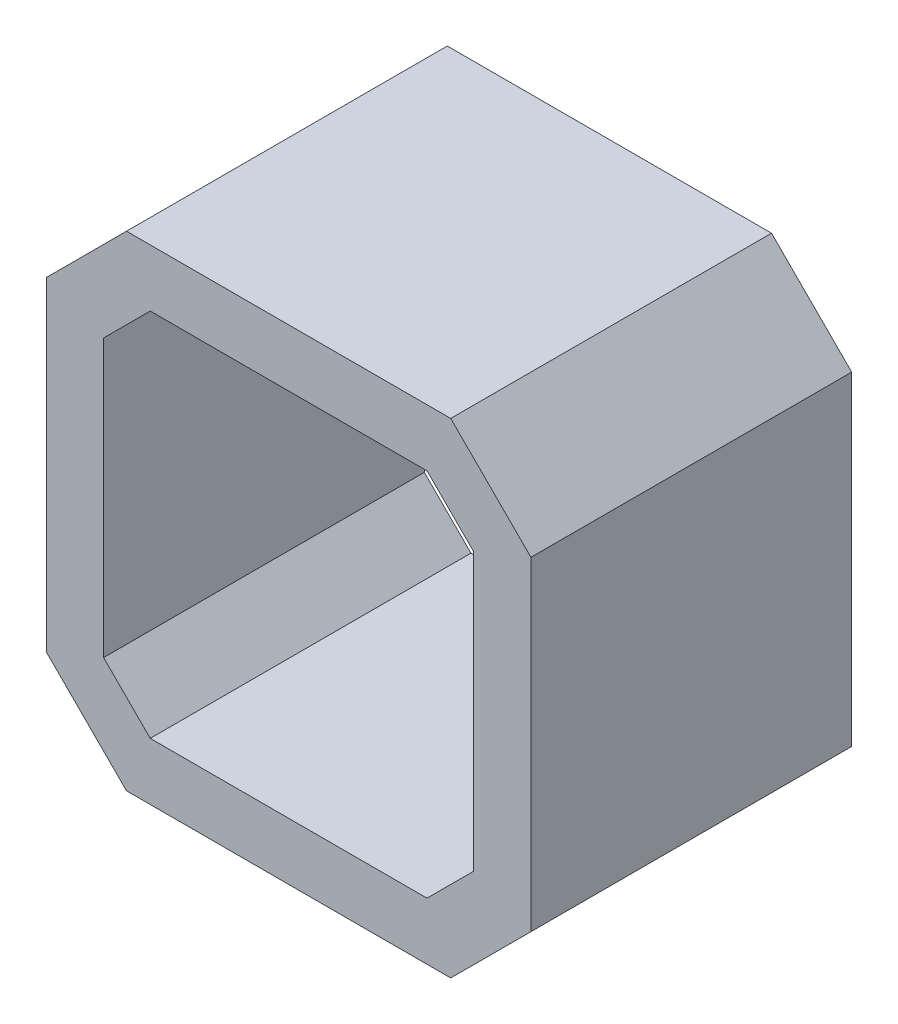
ISO-10303-21;
HEADER;
FILE_DESCRIPTION(('STEP AP214'),'2;1');
FILE_NAME('part.step','',(''),(''),'','','');
FILE_SCHEMA(('AUTOMOTIVE_DESIGN { 1 0 10303 214 1 1 1 1 }'));
ENDSEC;
DATA;
#1=APPLICATION_CONTEXT('core data for automotive mechanical design processes');
#2=APPLICATION_PROTOCOL_DEFINITION('international standard','automotive_design',2000,#1);
#3=PRODUCT_CONTEXT('',#1,'mechanical');
#4=PRODUCT('Part','Part','',(#3));
#5=PRODUCT_RELATED_PRODUCT_CATEGORY('part','',(#4));
#6=PRODUCT_DEFINITION_FORMATION('','',#4);
#7=PRODUCT_DEFINITION_CONTEXT('part definition',#1,'design');
#8=PRODUCT_DEFINITION('design','',#6,#7);
#9=PRODUCT_DEFINITION_SHAPE('','',#8);
#10=(LENGTH_UNIT() NAMED_UNIT(*) SI_UNIT(.MILLI.,.METRE.));
#11=(NAMED_UNIT(*) PLANE_ANGLE_UNIT() SI_UNIT($,.RADIAN.));
#12=(NAMED_UNIT(*) SI_UNIT($,.STERADIAN.) SOLID_ANGLE_UNIT());
#13=UNCERTAINTY_MEASURE_WITH_UNIT(LENGTH_MEASURE(1.E-05),#10,'distance_accuracy_value','');
#14=(GEOMETRIC_REPRESENTATION_CONTEXT(3) GLOBAL_UNCERTAINTY_ASSIGNED_CONTEXT((#13)) GLOBAL_UNIT_ASSIGNED_CONTEXT((#10,
#11,#12)) REPRESENTATION_CONTEXT('',''));
#15=CARTESIAN_POINT('',(0.,0.,0.));
#16=DIRECTION('',(0.,0.,1.));
#17=DIRECTION('',(1.,0.,0.));
#18=AXIS2_PLACEMENT_3D('',#15,#16,#17);
#19=CARTESIAN_POINT('',(0.,0.,28.));
#20=DIRECTION('',(0.,0.,-1.));
#21=DIRECTION('',(-1.,0.,0.));
#22=AXIS2_PLACEMENT_3D('',#19,#20,#21);
#23=PLANE('',#22);
#24=DIRECTION('',(0.,-1.,0.));
#25=VECTOR('',#24,1.);
#26=CARTESIAN_POINT('',(-21.15,-14.15,28.));
#27=LINE('',#26,#25);
#28=CARTESIAN_POINT('',(-21.15,14.15,28.));
#29=VERTEX_POINT('',#28);
#30=CARTESIAN_POINT('',(-21.15,-14.15,28.));
#31=VERTEX_POINT('',#30);
#32=EDGE_CURVE('E211',#29,#31,#27,.T.);
#33=ORIENTED_EDGE('',*,*,#32,.T.);
#34=DIRECTION('',(0.707106781186547,-0.707106781186547,0.));
#35=VECTOR('',#34,1.);
#36=CARTESIAN_POINT('',(-21.15,-14.15,28.));
#37=LINE('',#36,#35);
#38=CARTESIAN_POINT('',(-14.15,-21.15,28.));
#39=VERTEX_POINT('',#38);
#40=EDGE_CURVE('E214',#31,#39,#37,.T.);
#41=ORIENTED_EDGE('',*,*,#40,.T.);
#42=DIRECTION('',(1.,0.,0.));
#43=VECTOR('',#42,1.);
#44=CARTESIAN_POINT('',(-14.15,-21.15,28.));
#45=LINE('',#44,#43);
#46=CARTESIAN_POINT('',(14.15,-21.15,28.));
#47=VERTEX_POINT('',#46);
#48=EDGE_CURVE('E217',#39,#47,#45,.T.);
#49=ORIENTED_EDGE('',*,*,#48,.T.);
#50=DIRECTION('',(0.707106781186547,0.707106781186547,0.));
#51=VECTOR('',#50,1.);
#52=CARTESIAN_POINT('',(14.15,-21.15,28.));
#53=LINE('',#52,#51);
#54=CARTESIAN_POINT('',(21.15,-14.15,28.));
#55=VERTEX_POINT('',#54);
#56=EDGE_CURVE('E219',#47,#55,#53,.T.);
#57=ORIENTED_EDGE('',*,*,#56,.T.);
#58=DIRECTION('',(0.,1.,0.));
#59=VECTOR('',#58,1.);
#60=CARTESIAN_POINT('',(21.15,-14.15,28.));
#61=LINE('',#60,#59);
#62=CARTESIAN_POINT('',(21.15,14.15,28.));
#63=VERTEX_POINT('',#62);
#64=EDGE_CURVE('E221',#55,#63,#61,.T.);
#65=ORIENTED_EDGE('',*,*,#64,.T.);
#66=DIRECTION('',(-0.707106781186547,0.707106781186547,0.));
#67=VECTOR('',#66,1.);
#68=CARTESIAN_POINT('',(14.15,21.15,28.));
#69=LINE('',#68,#67);
#70=CARTESIAN_POINT('',(14.15,21.15,28.));
#71=VERTEX_POINT('',#70);
#72=EDGE_CURVE('E223',#63,#71,#69,.T.);
#73=ORIENTED_EDGE('',*,*,#72,.T.);
#74=DIRECTION('',(-1.,0.,0.));
#75=VECTOR('',#74,1.);
#76=CARTESIAN_POINT('',(-14.15,21.15,28.));
#77=LINE('',#76,#75);
#78=CARTESIAN_POINT('',(-14.15,21.15,28.));
#79=VERTEX_POINT('',#78);
#80=EDGE_CURVE('E225',#71,#79,#77,.T.);
#81=ORIENTED_EDGE('',*,*,#80,.T.);
#82=DIRECTION('',(-0.707106781186547,-0.707106781186547,0.));
#83=VECTOR('',#82,1.);
#84=CARTESIAN_POINT('',(-21.15,14.15,28.));
#85=LINE('',#84,#83);
#86=EDGE_CURVE('E227',#79,#29,#85,.T.);
#87=ORIENTED_EDGE('',*,*,#86,.T.);
#88=EDGE_LOOP('',(#33,#41,#49,#57,#65,#73,#81,#87));
#89=FACE_BOUND('',#88,.T.);
#90=DIRECTION('',(-0.707106781186547,-0.707106781186547,0.));
#91=VECTOR('',#90,1.);
#92=CARTESIAN_POINT('',(-16.15,12.0789321881345,28.));
#93=LINE('',#92,#91);
#94=CARTESIAN_POINT('',(-12.0789321881345,16.15,28.));
#95=VERTEX_POINT('',#94);
#96=CARTESIAN_POINT('',(-16.15,12.0789321881345,28.));
#97=VERTEX_POINT('',#96);
#98=EDGE_CURVE('E146',#95,#97,#93,.T.);
#99=ORIENTED_EDGE('',*,*,#98,.F.);
#100=DIRECTION('',(-1.,0.,0.));
#101=VECTOR('',#100,1.);
#102=CARTESIAN_POINT('',(-12.0789321881345,16.15,28.));
#103=LINE('',#102,#101);
#104=CARTESIAN_POINT('',(12.0789321881345,16.15,28.));
#105=VERTEX_POINT('',#104);
#106=EDGE_CURVE('E179',#105,#95,#103,.T.);
#107=ORIENTED_EDGE('',*,*,#106,.F.);
#108=DIRECTION('',(-0.707106781186547,0.707106781186547,0.));
#109=VECTOR('',#108,1.);
#110=CARTESIAN_POINT('',(12.0789321881345,16.15,28.));
#111=LINE('',#110,#109);
#112=CARTESIAN_POINT('',(16.15,12.0789321881345,28.));
#113=VERTEX_POINT('',#112);
#114=EDGE_CURVE('E177',#113,#105,#111,.T.);
#115=ORIENTED_EDGE('',*,*,#114,.F.);
#116=DIRECTION('',(0.,1.,0.));
#117=VECTOR('',#116,1.);
#118=CARTESIAN_POINT('',(16.15,-12.0789321881345,28.));
#119=LINE('',#118,#117);
#120=CARTESIAN_POINT('',(16.15,-12.0789321881345,28.));
#121=VERTEX_POINT('',#120);
#122=EDGE_CURVE('E175',#121,#113,#119,.T.);
#123=ORIENTED_EDGE('',*,*,#122,.F.);
#124=DIRECTION('',(0.707106781186547,0.707106781186547,0.));
#125=VECTOR('',#124,1.);
#126=CARTESIAN_POINT('',(12.0789321881345,-16.15,28.));
#127=LINE('',#126,#125);
#128=CARTESIAN_POINT('',(12.0789321881345,-16.15,28.));
#129=VERTEX_POINT('',#128);
#130=EDGE_CURVE('E173',#129,#121,#127,.T.);
#131=ORIENTED_EDGE('',*,*,#130,.F.);
#132=DIRECTION('',(1.,0.,0.));
#133=VECTOR('',#132,1.);
#134=CARTESIAN_POINT('',(-12.0789321881345,-16.15,28.));
#135=LINE('',#134,#133);
#136=CARTESIAN_POINT('',(-12.0789321881345,-16.15,28.));
#137=VERTEX_POINT('',#136);
#138=EDGE_CURVE('E169',#137,#129,#135,.T.);
#139=ORIENTED_EDGE('',*,*,#138,.F.);
#140=DIRECTION('',(0.707106781186547,-0.707106781186547,0.));
#141=VECTOR('',#140,1.);
#142=CARTESIAN_POINT('',(-16.15,-12.0789321881345,28.));
#143=LINE('',#142,#141);
#144=CARTESIAN_POINT('',(-16.15,-12.0789321881345,28.));
#145=VERTEX_POINT('',#144);
#146=EDGE_CURVE('E167',#145,#137,#143,.T.);
#147=ORIENTED_EDGE('',*,*,#146,.F.);
#148=DIRECTION('',(0.,-1.,0.));
#149=VECTOR('',#148,1.);
#150=CARTESIAN_POINT('',(-16.15,-12.0789321881345,28.));
#151=LINE('',#150,#149);
#152=EDGE_CURVE('E154',#97,#145,#151,.T.);
#153=ORIENTED_EDGE('',*,*,#152,.F.);
#154=EDGE_LOOP('',(#99,#107,#115,#123,#131,#139,#147,#153));
#155=FACE_BOUND('',#154,.T.);
#156=ADVANCED_FACE('F33',(#89,#155),#23,.F.);
#157=CARTESIAN_POINT('',(0.,0.,0.));
#158=DIRECTION('',(0.,0.,-1.));
#159=DIRECTION('',(-1.,0.,0.));
#160=AXIS2_PLACEMENT_3D('',#157,#158,#159);
#161=PLANE('',#160);
#162=DIRECTION('',(0.,-1.,0.));
#163=VECTOR('',#162,1.);
#164=CARTESIAN_POINT('',(-21.15,-14.15,0.));
#165=LINE('',#164,#163);
#166=CARTESIAN_POINT('',(-21.15,14.15,0.));
#167=VERTEX_POINT('',#166);
#168=CARTESIAN_POINT('',(-21.15,-14.15,0.));
#169=VERTEX_POINT('',#168);
#170=EDGE_CURVE('E162',#167,#169,#165,.T.);
#171=ORIENTED_EDGE('',*,*,#170,.F.);
#172=DIRECTION('',(-0.707106781186547,-0.707106781186547,0.));
#173=VECTOR('',#172,1.);
#174=CARTESIAN_POINT('',(-21.15,14.15,0.));
#175=LINE('',#174,#173);
#176=CARTESIAN_POINT('',(-14.15,21.15,0.));
#177=VERTEX_POINT('',#176);
#178=EDGE_CURVE('E215',#177,#167,#175,.T.);
#179=ORIENTED_EDGE('',*,*,#178,.F.);
#180=DIRECTION('',(-1.,0.,0.));
#181=VECTOR('',#180,1.);
#182=CARTESIAN_POINT('',(-14.15,21.15,0.));
#183=LINE('',#182,#181);
#184=CARTESIAN_POINT('',(14.15,21.15,0.));
#185=VERTEX_POINT('',#184);
#186=EDGE_CURVE('E242',#185,#177,#183,.T.);
#187=ORIENTED_EDGE('',*,*,#186,.F.);
#188=DIRECTION('',(-0.707106781186547,0.707106781186547,0.));
#189=VECTOR('',#188,1.);
#190=CARTESIAN_POINT('',(14.15,21.15,0.));
#191=LINE('',#190,#189);
#192=CARTESIAN_POINT('',(21.15,14.15,0.));
#193=VERTEX_POINT('',#192);
#194=EDGE_CURVE('E240',#193,#185,#191,.T.);
#195=ORIENTED_EDGE('',*,*,#194,.F.);
#196=DIRECTION('',(0.,1.,0.));
#197=VECTOR('',#196,1.);
#198=CARTESIAN_POINT('',(21.15,-14.15,0.));
#199=LINE('',#198,#197);
#200=CARTESIAN_POINT('',(21.15,-14.15,0.));
#201=VERTEX_POINT('',#200);
#202=EDGE_CURVE('E238',#201,#193,#199,.T.);
#203=ORIENTED_EDGE('',*,*,#202,.F.);
#204=DIRECTION('',(0.707106781186547,0.707106781186547,0.));
#205=VECTOR('',#204,1.);
#206=CARTESIAN_POINT('',(14.15,-21.15,0.));
#207=LINE('',#206,#205);
#208=CARTESIAN_POINT('',(14.15,-21.15,0.));
#209=VERTEX_POINT('',#208);
#210=EDGE_CURVE('E236',#209,#201,#207,.T.);
#211=ORIENTED_EDGE('',*,*,#210,.F.);
#212=DIRECTION('',(1.,0.,0.));
#213=VECTOR('',#212,1.);
#214=CARTESIAN_POINT('',(-14.15,-21.15,0.));
#215=LINE('',#214,#213);
#216=CARTESIAN_POINT('',(-14.15,-21.15,0.));
#217=VERTEX_POINT('',#216);
#218=EDGE_CURVE('E234',#217,#209,#215,.T.);
#219=ORIENTED_EDGE('',*,*,#218,.F.);
#220=DIRECTION('',(0.707106781186547,-0.707106781186547,0.));
#221=VECTOR('',#220,1.);
#222=CARTESIAN_POINT('',(-21.15,-14.15,0.));
#223=LINE('',#222,#221);
#224=EDGE_CURVE('E232',#169,#217,#223,.T.);
#225=ORIENTED_EDGE('',*,*,#224,.F.);
#226=EDGE_LOOP('',(#171,#179,#187,#195,#203,#211,#219,#225));
#227=FACE_BOUND('',#226,.T.);
#228=DIRECTION('',(-1.,0.,0.));
#229=VECTOR('',#228,1.);
#230=CARTESIAN_POINT('',(-12.0789321881345,16.15,0.));
#231=LINE('',#230,#229);
#232=CARTESIAN_POINT('',(12.0789321881345,16.15,0.));
#233=VERTEX_POINT('',#232);
#234=CARTESIAN_POINT('',(-12.0789321881345,16.15,0.));
#235=VERTEX_POINT('',#234);
#236=EDGE_CURVE('E155',#233,#235,#231,.T.);
#237=ORIENTED_EDGE('',*,*,#236,.T.);
#238=DIRECTION('',(-0.707106781186547,-0.707106781186547,0.));
#239=VECTOR('',#238,1.);
#240=CARTESIAN_POINT('',(-16.15,12.0789321881345,0.));
#241=LINE('',#240,#239);
#242=CARTESIAN_POINT('',(-16.15,12.0789321881345,0.));
#243=VERTEX_POINT('',#242);
#244=EDGE_CURVE('E56',#235,#243,#241,.T.);
#245=ORIENTED_EDGE('',*,*,#244,.T.);
#246=DIRECTION('',(0.,-1.,0.));
#247=VECTOR('',#246,1.);
#248=CARTESIAN_POINT('',(-16.15,-12.0789321881345,0.));
#249=LINE('',#248,#247);
#250=CARTESIAN_POINT('',(-16.15,-12.0789321881345,0.));
#251=VERTEX_POINT('',#250);
#252=EDGE_CURVE('E161',#243,#251,#249,.T.);
#253=ORIENTED_EDGE('',*,*,#252,.T.);
#254=DIRECTION('',(0.707106781186547,-0.707106781186547,0.));
#255=VECTOR('',#254,1.);
#256=CARTESIAN_POINT('',(-16.15,-12.0789321881345,0.));
#257=LINE('',#256,#255);
#258=CARTESIAN_POINT('',(-12.0789321881345,-16.15,0.));
#259=VERTEX_POINT('',#258);
#260=EDGE_CURVE('E183',#251,#259,#257,.T.);
#261=ORIENTED_EDGE('',*,*,#260,.T.);
#262=DIRECTION('',(1.,0.,0.));
#263=VECTOR('',#262,1.);
#264=CARTESIAN_POINT('',(-12.0789321881345,-16.15,0.));
#265=LINE('',#264,#263);
#266=CARTESIAN_POINT('',(12.0789321881345,-16.15,0.));
#267=VERTEX_POINT('',#266);
#268=EDGE_CURVE('E186',#259,#267,#265,.T.);
#269=ORIENTED_EDGE('',*,*,#268,.T.);
#270=DIRECTION('',(0.707106781186547,0.707106781186547,0.));
#271=VECTOR('',#270,1.);
#272=CARTESIAN_POINT('',(12.0789321881345,-16.15,0.));
#273=LINE('',#272,#271);
#274=CARTESIAN_POINT('',(16.15,-12.0789321881345,0.));
#275=VERTEX_POINT('',#274);
#276=EDGE_CURVE('E189',#267,#275,#273,.T.);
#277=ORIENTED_EDGE('',*,*,#276,.T.);
#278=DIRECTION('',(0.,1.,0.));
#279=VECTOR('',#278,1.);
#280=CARTESIAN_POINT('',(16.15,-12.0789321881345,0.));
#281=LINE('',#280,#279);
#282=CARTESIAN_POINT('',(16.15,12.0789321881345,0.));
#283=VERTEX_POINT('',#282);
#284=EDGE_CURVE('E192',#275,#283,#281,.T.);
#285=ORIENTED_EDGE('',*,*,#284,.T.);
#286=DIRECTION('',(-0.707106781186547,0.707106781186547,0.));
#287=VECTOR('',#286,1.);
#288=CARTESIAN_POINT('',(12.0789321881345,16.15,0.));
#289=LINE('',#288,#287);
#290=EDGE_CURVE('E195',#283,#233,#289,.T.);
#291=ORIENTED_EDGE('',*,*,#290,.T.);
#292=EDGE_LOOP('',(#237,#245,#253,#261,#269,#277,#285,#291));
#293=FACE_BOUND('',#292,.T.);
#294=ADVANCED_FACE('F272',(#227,#293),#161,.T.);
#295=CARTESIAN_POINT('',(-21.15,-14.15,28.));
#296=DIRECTION('',(1.,0.,0.));
#297=DIRECTION('',(0.,0.,-1.));
#298=AXIS2_PLACEMENT_3D('',#295,#296,#297);
#299=PLANE('',#298);
#300=ORIENTED_EDGE('',*,*,#170,.T.);
#301=DIRECTION('',(0.,0.,-1.));
#302=VECTOR('',#301,1.);
#303=CARTESIAN_POINT('',(-21.15,-14.15,28.));
#304=LINE('',#303,#302);
#305=EDGE_CURVE('E11',#31,#169,#304,.T.);
#306=ORIENTED_EDGE('',*,*,#305,.F.);
#307=ORIENTED_EDGE('',*,*,#32,.F.);
#308=DIRECTION('',(0.,0.,-1.));
#309=VECTOR('',#308,1.);
#310=CARTESIAN_POINT('',(-21.15,14.15,28.));
#311=LINE('',#310,#309);
#312=EDGE_CURVE('E229',#29,#167,#311,.T.);
#313=ORIENTED_EDGE('',*,*,#312,.T.);
#314=EDGE_LOOP('',(#300,#306,#307,#313));
#315=FACE_BOUND('',#314,.T.);
#316=ADVANCED_FACE('F35',(#315),#299,.F.);
#317=CARTESIAN_POINT('',(-21.15,-14.15,28.));
#318=DIRECTION('',(0.707106781186548,0.707106781186548,0.));
#319=DIRECTION('',(-0.707106781186548,0.707106781186548,0.));
#320=AXIS2_PLACEMENT_3D('',#317,#318,#319);
#321=PLANE('',#320);
#322=ORIENTED_EDGE('',*,*,#224,.T.);
#323=DIRECTION('',(0.,0.,-1.));
#324=VECTOR('',#323,1.);
#325=CARTESIAN_POINT('',(-14.15,-21.15,28.));
#326=LINE('',#325,#324);
#327=EDGE_CURVE('E41',#39,#217,#326,.T.);
#328=ORIENTED_EDGE('',*,*,#327,.F.);
#329=ORIENTED_EDGE('',*,*,#40,.F.);
#330=ORIENTED_EDGE('',*,*,#305,.T.);
#331=EDGE_LOOP('',(#322,#328,#329,#330));
#332=FACE_BOUND('',#331,.T.);
#333=ADVANCED_FACE('F289',(#332),#321,.F.);
#334=CARTESIAN_POINT('',(-14.15,-21.15,28.));
#335=DIRECTION('',(0.,1.,0.));
#336=DIRECTION('',(0.,0.,1.));
#337=AXIS2_PLACEMENT_3D('',#334,#335,#336);
#338=PLANE('',#337);
#339=ORIENTED_EDGE('',*,*,#218,.T.);
#340=DIRECTION('',(0.,0.,-1.));
#341=VECTOR('',#340,1.);
#342=CARTESIAN_POINT('',(14.15,-21.15,28.));
#343=LINE('',#342,#341);
#344=EDGE_CURVE('E259',#47,#209,#343,.T.);
#345=ORIENTED_EDGE('',*,*,#344,.F.);
#346=ORIENTED_EDGE('',*,*,#48,.F.);
#347=ORIENTED_EDGE('',*,*,#327,.T.);
#348=EDGE_LOOP('',(#339,#345,#346,#347));
#349=FACE_BOUND('',#348,.T.);
#350=ADVANCED_FACE('F266',(#349),#338,.F.);
#351=CARTESIAN_POINT('',(14.15,-21.15,28.));
#352=DIRECTION('',(-0.707106781186548,0.707106781186548,0.));
#353=DIRECTION('',(-0.707106781186548,-0.707106781186548,0.));
#354=AXIS2_PLACEMENT_3D('',#351,#352,#353);
#355=PLANE('',#354);
#356=ORIENTED_EDGE('',*,*,#210,.T.);
#357=DIRECTION('',(0.,0.,-1.));
#358=VECTOR('',#357,1.);
#359=CARTESIAN_POINT('',(21.15,-14.15,28.));
#360=LINE('',#359,#358);
#361=EDGE_CURVE('E256',#55,#201,#360,.T.);
#362=ORIENTED_EDGE('',*,*,#361,.F.);
#363=ORIENTED_EDGE('',*,*,#56,.F.);
#364=ORIENTED_EDGE('',*,*,#344,.T.);
#365=EDGE_LOOP('',(#356,#362,#363,#364));
#366=FACE_BOUND('',#365,.T.);
#367=ADVANCED_FACE('F278',(#366),#355,.F.);
#368=CARTESIAN_POINT('',(21.15,-14.15,28.));
#369=DIRECTION('',(-1.,0.,0.));
#370=DIRECTION('',(0.,0.,1.));
#371=AXIS2_PLACEMENT_3D('',#368,#369,#370);
#372=PLANE('',#371);
#373=ORIENTED_EDGE('',*,*,#202,.T.);
#374=DIRECTION('',(0.,0.,-1.));
#375=VECTOR('',#374,1.);
#376=CARTESIAN_POINT('',(21.15,14.15,28.));
#377=LINE('',#376,#375);
#378=EDGE_CURVE('E253',#63,#193,#377,.T.);
#379=ORIENTED_EDGE('',*,*,#378,.F.);
#380=ORIENTED_EDGE('',*,*,#64,.F.);
#381=ORIENTED_EDGE('',*,*,#361,.T.);
#382=EDGE_LOOP('',(#373,#379,#380,#381));
#383=FACE_BOUND('',#382,.T.);
#384=ADVANCED_FACE('F282',(#383),#372,.F.);
#385=CARTESIAN_POINT('',(14.15,21.15,28.));
#386=DIRECTION('',(-0.707106781186548,-0.707106781186548,0.));
#387=DIRECTION('',(0.707106781186548,-0.707106781186548,0.));
#388=AXIS2_PLACEMENT_3D('',#385,#386,#387);
#389=PLANE('',#388);
#390=ORIENTED_EDGE('',*,*,#194,.T.);
#391=DIRECTION('',(0.,0.,-1.));
#392=VECTOR('',#391,1.);
#393=CARTESIAN_POINT('',(14.15,21.15,28.));
#394=LINE('',#393,#392);
#395=EDGE_CURVE('E250',#71,#185,#394,.T.);
#396=ORIENTED_EDGE('',*,*,#395,.F.);
#397=ORIENTED_EDGE('',*,*,#72,.F.);
#398=ORIENTED_EDGE('',*,*,#378,.T.);
#399=EDGE_LOOP('',(#390,#396,#397,#398));
#400=FACE_BOUND('',#399,.T.);
#401=ADVANCED_FACE('F302',(#400),#389,.F.);
#402=CARTESIAN_POINT('',(-14.15,21.15,28.));
#403=DIRECTION('',(0.,-1.,0.));
#404=DIRECTION('',(0.,0.,-1.));
#405=AXIS2_PLACEMENT_3D('',#402,#403,#404);
#406=PLANE('',#405);
#407=ORIENTED_EDGE('',*,*,#186,.T.);
#408=DIRECTION('',(0.,0.,-1.));
#409=VECTOR('',#408,1.);
#410=CARTESIAN_POINT('',(-14.15,21.15,28.));
#411=LINE('',#410,#409);
#412=EDGE_CURVE('E247',#79,#177,#411,.T.);
#413=ORIENTED_EDGE('',*,*,#412,.F.);
#414=ORIENTED_EDGE('',*,*,#80,.F.);
#415=ORIENTED_EDGE('',*,*,#395,.T.);
#416=EDGE_LOOP('',(#407,#413,#414,#415));
#417=FACE_BOUND('',#416,.T.);
#418=ADVANCED_FACE('F300',(#417),#406,.F.);
#419=CARTESIAN_POINT('',(-21.15,14.15,28.));
#420=DIRECTION('',(0.707106781186548,-0.707106781186548,0.));
#421=DIRECTION('',(0.707106781186548,0.707106781186548,0.));
#422=AXIS2_PLACEMENT_3D('',#419,#420,#421);
#423=PLANE('',#422);
#424=ORIENTED_EDGE('',*,*,#178,.T.);
#425=ORIENTED_EDGE('',*,*,#312,.F.);
#426=ORIENTED_EDGE('',*,*,#86,.F.);
#427=ORIENTED_EDGE('',*,*,#412,.T.);
#428=EDGE_LOOP('',(#424,#425,#426,#427));
#429=FACE_BOUND('',#428,.T.);
#430=ADVANCED_FACE('F295',(#429),#423,.F.);
#431=CARTESIAN_POINT('',(-16.15,12.0789321881345,28.));
#432=DIRECTION('',(0.707106781186548,-0.707106781186548,0.));
#433=DIRECTION('',(0.707106781186548,0.707106781186548,0.));
#434=AXIS2_PLACEMENT_3D('',#431,#432,#433);
#435=PLANE('',#434);
#436=ORIENTED_EDGE('',*,*,#244,.F.);
#437=DIRECTION('',(0.,0.,-1.));
#438=VECTOR('',#437,1.);
#439=CARTESIAN_POINT('',(-12.0789321881345,16.15,28.));
#440=LINE('',#439,#438);
#441=EDGE_CURVE('E150',#95,#235,#440,.T.);
#442=ORIENTED_EDGE('',*,*,#441,.F.);
#443=ORIENTED_EDGE('',*,*,#98,.T.);
#444=DIRECTION('',(0.,0.,-1.));
#445=VECTOR('',#444,1.);
#446=CARTESIAN_POINT('',(-16.15,12.0789321881345,28.));
#447=LINE('',#446,#445);
#448=EDGE_CURVE('E149',#97,#243,#447,.T.);
#449=ORIENTED_EDGE('',*,*,#448,.T.);
#450=EDGE_LOOP('',(#436,#442,#443,#449));
#451=FACE_BOUND('',#450,.T.);
#452=ADVANCED_FACE('F148',(#451),#435,.T.);
#453=CARTESIAN_POINT('',(-16.15,-12.0789321881345,28.));
#454=DIRECTION('',(1.,0.,0.));
#455=DIRECTION('',(0.,0.,-1.));
#456=AXIS2_PLACEMENT_3D('',#453,#454,#455);
#457=PLANE('',#456);
#458=ORIENTED_EDGE('',*,*,#252,.F.);
#459=ORIENTED_EDGE('',*,*,#448,.F.);
#460=ORIENTED_EDGE('',*,*,#152,.T.);
#461=DIRECTION('',(0.,0.,-1.));
#462=VECTOR('',#461,1.);
#463=CARTESIAN_POINT('',(-16.15,-12.0789321881345,28.));
#464=LINE('',#463,#462);
#465=EDGE_CURVE('E163',#145,#251,#464,.T.);
#466=ORIENTED_EDGE('',*,*,#465,.T.);
#467=EDGE_LOOP('',(#458,#459,#460,#466));
#468=FACE_BOUND('',#467,.T.);
#469=ADVANCED_FACE('F158',(#468),#457,.T.);
#470=CARTESIAN_POINT('',(-16.15,-12.0789321881345,28.));
#471=DIRECTION('',(0.707106781186548,0.707106781186548,0.));
#472=DIRECTION('',(-0.707106781186548,0.707106781186548,0.));
#473=AXIS2_PLACEMENT_3D('',#470,#471,#472);
#474=PLANE('',#473);
#475=ORIENTED_EDGE('',*,*,#260,.F.);
#476=ORIENTED_EDGE('',*,*,#465,.F.);
#477=ORIENTED_EDGE('',*,*,#146,.T.);
#478=DIRECTION('',(0.,0.,-1.));
#479=VECTOR('',#478,1.);
#480=CARTESIAN_POINT('',(-12.0789321881345,-16.15,28.));
#481=LINE('',#480,#479);
#482=EDGE_CURVE('E208',#137,#259,#481,.T.);
#483=ORIENTED_EDGE('',*,*,#482,.T.);
#484=EDGE_LOOP('',(#475,#476,#477,#483));
#485=FACE_BOUND('',#484,.T.);
#486=ADVANCED_FACE('F327',(#485),#474,.T.);
#487=CARTESIAN_POINT('',(-12.0789321881345,-16.15,28.));
#488=DIRECTION('',(0.,1.,0.));
#489=DIRECTION('',(0.,0.,1.));
#490=AXIS2_PLACEMENT_3D('',#487,#488,#489);
#491=PLANE('',#490);
#492=ORIENTED_EDGE('',*,*,#268,.F.);
#493=ORIENTED_EDGE('',*,*,#482,.F.);
#494=ORIENTED_EDGE('',*,*,#138,.T.);
#495=DIRECTION('',(0.,0.,-1.));
#496=VECTOR('',#495,1.);
#497=CARTESIAN_POINT('',(12.0789321881345,-16.15,28.));
#498=LINE('',#497,#496);
#499=EDGE_CURVE('E206',#129,#267,#498,.T.);
#500=ORIENTED_EDGE('',*,*,#499,.T.);
#501=EDGE_LOOP('',(#492,#493,#494,#500));
#502=FACE_BOUND('',#501,.T.);
#503=ADVANCED_FACE('F331',(#502),#491,.T.);
#504=CARTESIAN_POINT('',(12.0789321881345,-16.15,28.));
#505=DIRECTION('',(-0.707106781186548,0.707106781186548,0.));
#506=DIRECTION('',(-0.707106781186548,-0.707106781186548,0.));
#507=AXIS2_PLACEMENT_3D('',#504,#505,#506);
#508=PLANE('',#507);
#509=ORIENTED_EDGE('',*,*,#276,.F.);
#510=ORIENTED_EDGE('',*,*,#499,.F.);
#511=ORIENTED_EDGE('',*,*,#130,.T.);
#512=DIRECTION('',(0.,0.,-1.));
#513=VECTOR('',#512,1.);
#514=CARTESIAN_POINT('',(16.15,-12.0789321881345,28.));
#515=LINE('',#514,#513);
#516=EDGE_CURVE('E204',#121,#275,#515,.T.);
#517=ORIENTED_EDGE('',*,*,#516,.T.);
#518=EDGE_LOOP('',(#509,#510,#511,#517));
#519=FACE_BOUND('',#518,.T.);
#520=ADVANCED_FACE('F337',(#519),#508,.T.);
#521=CARTESIAN_POINT('',(16.15,-12.0789321881345,28.));
#522=DIRECTION('',(-1.,0.,0.));
#523=DIRECTION('',(0.,0.,1.));
#524=AXIS2_PLACEMENT_3D('',#521,#522,#523);
#525=PLANE('',#524);
#526=ORIENTED_EDGE('',*,*,#284,.F.);
#527=ORIENTED_EDGE('',*,*,#516,.F.);
#528=ORIENTED_EDGE('',*,*,#122,.T.);
#529=DIRECTION('',(0.,0.,-1.));
#530=VECTOR('',#529,1.);
#531=CARTESIAN_POINT('',(16.15,12.0789321881345,28.));
#532=LINE('',#531,#530);
#533=EDGE_CURVE('E202',#113,#283,#532,.T.);
#534=ORIENTED_EDGE('',*,*,#533,.T.);
#535=EDGE_LOOP('',(#526,#527,#528,#534));
#536=FACE_BOUND('',#535,.T.);
#537=ADVANCED_FACE('F341',(#536),#525,.T.);
#538=CARTESIAN_POINT('',(12.0789321881345,16.15,28.));
#539=DIRECTION('',(-0.707106781186548,-0.707106781186548,0.));
#540=DIRECTION('',(0.707106781186548,-0.707106781186548,0.));
#541=AXIS2_PLACEMENT_3D('',#538,#539,#540);
#542=PLANE('',#541);
#543=ORIENTED_EDGE('',*,*,#290,.F.);
#544=ORIENTED_EDGE('',*,*,#533,.F.);
#545=ORIENTED_EDGE('',*,*,#114,.T.);
#546=DIRECTION('',(0.,0.,-1.));
#547=VECTOR('',#546,1.);
#548=CARTESIAN_POINT('',(12.0789321881345,16.15,28.));
#549=LINE('',#548,#547);
#550=EDGE_CURVE('E48',#105,#233,#549,.T.);
#551=ORIENTED_EDGE('',*,*,#550,.T.);
#552=EDGE_LOOP('',(#543,#544,#545,#551));
#553=FACE_BOUND('',#552,.T.);
#554=ADVANCED_FACE('F345',(#553),#542,.T.);
#555=CARTESIAN_POINT('',(-12.0789321881345,16.15,28.));
#556=DIRECTION('',(0.,-1.,0.));
#557=DIRECTION('',(0.,0.,-1.));
#558=AXIS2_PLACEMENT_3D('',#555,#556,#557);
#559=PLANE('',#558);
#560=ORIENTED_EDGE('',*,*,#236,.F.);
#561=ORIENTED_EDGE('',*,*,#550,.F.);
#562=ORIENTED_EDGE('',*,*,#106,.T.);
#563=ORIENTED_EDGE('',*,*,#441,.T.);
#564=EDGE_LOOP('',(#560,#561,#562,#563));
#565=FACE_BOUND('',#564,.T.);
#566=ADVANCED_FACE('F349',(#565),#559,.T.);
#567=CLOSED_SHELL('',(#156,#294,#316,#333,#350,#367,#384,#401,#418,#430,#452,#469,#486,#503,
#520,#537,#554,#566));
#568=MANIFOLD_SOLID_BREP('B2',#567);
#569=ADVANCED_BREP_SHAPE_REPRESENTATION('',(#18,#568),#14);
#570=SHAPE_DEFINITION_REPRESENTATION(#9,#569);
ENDSEC;
END-ISO-10303-21;
